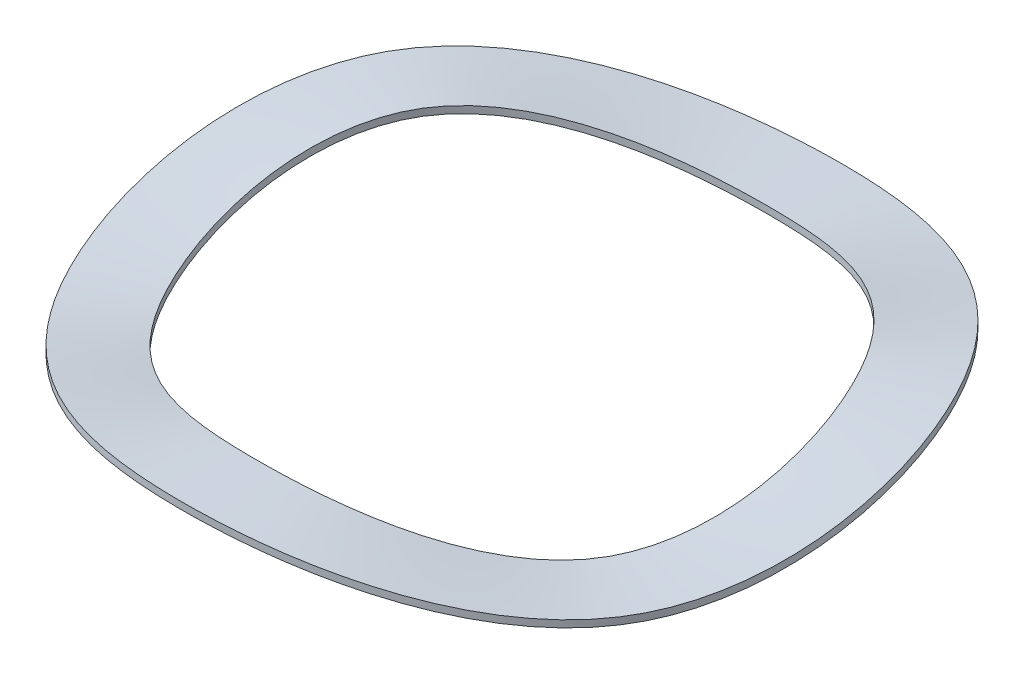
ISO-10303-21;
HEADER;
FILE_DESCRIPTION(('STEP AP214'),'2;1');
FILE_NAME('part.step','',(''),(''),'','','');
FILE_SCHEMA(('AUTOMOTIVE_DESIGN { 1 0 10303 214 1 1 1 1 }'));
ENDSEC;
DATA;
#1=APPLICATION_CONTEXT('core data for automotive mechanical design processes');
#2=APPLICATION_PROTOCOL_DEFINITION('international standard','automotive_design',2000,#1);
#3=PRODUCT_CONTEXT('',#1,'mechanical');
#4=PRODUCT('Part','Part','',(#3));
#5=PRODUCT_RELATED_PRODUCT_CATEGORY('part','',(#4));
#6=PRODUCT_DEFINITION_FORMATION('','',#4);
#7=PRODUCT_DEFINITION_CONTEXT('part definition',#1,'design');
#8=PRODUCT_DEFINITION('design','',#6,#7);
#9=PRODUCT_DEFINITION_SHAPE('','',#8);
#10=(LENGTH_UNIT() NAMED_UNIT(*) SI_UNIT(.MILLI.,.METRE.));
#11=(NAMED_UNIT(*) PLANE_ANGLE_UNIT() SI_UNIT($,.RADIAN.));
#12=(NAMED_UNIT(*) SI_UNIT($,.STERADIAN.) SOLID_ANGLE_UNIT());
#13=UNCERTAINTY_MEASURE_WITH_UNIT(LENGTH_MEASURE(1.E-05),#10,'distance_accuracy_value','');
#14=(GEOMETRIC_REPRESENTATION_CONTEXT(3) GLOBAL_UNCERTAINTY_ASSIGNED_CONTEXT((#13)) GLOBAL_UNIT_ASSIGNED_CONTEXT((#10,
#11,#12)) REPRESENTATION_CONTEXT('',''));
#15=CARTESIAN_POINT('',(0.,0.,0.));
#16=DIRECTION('',(0.,0.,1.));
#17=DIRECTION('',(1.,0.,0.));
#18=AXIS2_PLACEMENT_3D('',#15,#16,#17);
#19=CARTESIAN_POINT('',(0.,0.,-10.6553));
#20=CARTESIAN_POINT('',(3.69110419397773,0.,-10.6553));
#21=CARTESIAN_POINT('',(11.0733125819332,3.1242,-6.39318));
#22=CARTESIAN_POINT('',(11.0733125819332,-1.5621,6.39318000000003));
#23=CARTESIAN_POINT('',(0.,3.12419999999999,12.78636));
#24=CARTESIAN_POINT('',(-11.0733125819332,-1.5621,6.39317999999996));
#25=CARTESIAN_POINT('',(-11.0733125819332,1.5621,-2.13106000000005));
#26=CARTESIAN_POINT('',(-7.38220838795543,1.5621,-8.52424000000004));
#27=CARTESIAN_POINT('',(-3.69110419397772,0.,-10.6553));
#28=CARTESIAN_POINT('',(0.,0.,-10.6553));
#29=CARTESIAN_POINT('',(0.,0.,-11.6755333333333));
#30=CARTESIAN_POINT('',(4.04452338775946,0.,-11.6755333333333));
#31=CARTESIAN_POINT('',(12.1335701632784,3.1242,-7.00532));
#32=CARTESIAN_POINT('',(12.1335701632784,-1.5621,7.00532000000003));
#33=CARTESIAN_POINT('',(0.,3.1242,14.01064));
#34=CARTESIAN_POINT('',(-12.1335701632785,-1.5621,7.00531999999996));
#35=CARTESIAN_POINT('',(-12.1335701632784,1.5621,-2.33510666666672));
#36=CARTESIAN_POINT('',(-8.08904677551891,1.5621,-9.34042666666671));
#37=CARTESIAN_POINT('',(-4.04452338775946,0.,-11.6755333333333));
#38=CARTESIAN_POINT('',(0.,0.,-11.6755333333333));
#39=CARTESIAN_POINT('',(0.,0.,-12.6957666666667));
#40=CARTESIAN_POINT('',(4.3979425815412,0.,-12.6957666666667));
#41=CARTESIAN_POINT('',(13.1938277446236,3.1242,-7.61746));
#42=CARTESIAN_POINT('',(13.1938277446236,-1.5621,7.61746000000003));
#43=CARTESIAN_POINT('',(0.,3.1242,15.23492));
#44=CARTESIAN_POINT('',(-13.1938277446237,-1.5621,7.61745999999995));
#45=CARTESIAN_POINT('',(-13.1938277446236,1.5621,-2.53915333333339));
#46=CARTESIAN_POINT('',(-8.79588516308238,1.5621,-10.1566133333334));
#47=CARTESIAN_POINT('',(-4.3979425815412,0.,-12.6957666666667));
#48=CARTESIAN_POINT('',(0.,0.,-12.6957666666667));
#49=CARTESIAN_POINT('',(0.,0.,-13.716));
#50=CARTESIAN_POINT('',(4.75136177532294,0.,-13.716));
#51=CARTESIAN_POINT('',(14.2540853259689,3.1242,-8.2296));
#52=CARTESIAN_POINT('',(14.2540853259688,-1.5621,8.22960000000003));
#53=CARTESIAN_POINT('',(0.,3.1242,16.4592));
#54=CARTESIAN_POINT('',(-14.2540853259689,-1.5621,8.22959999999994));
#55=CARTESIAN_POINT('',(-14.2540853259688,1.5621,-2.74320000000006));
#56=CARTESIAN_POINT('',(-9.50272355064585,1.5621,-10.9728));
#57=CARTESIAN_POINT('',(-4.75136177532293,0.,-13.716));
#58=CARTESIAN_POINT('',(0.,0.,-13.716));
#59=B_SPLINE_SURFACE_WITH_KNOTS('',3,3,((#19,#20,#21,#22,#23,#24,#25,#26,#27,#28),(#29,#30,#31,
#32,#33,#34,#35,#36,#37,#38),(#39,#40,#41,#42,#43,#44,#45,#46,#47,#48),(#49,#50,#51,#52,#53,#54,
#55,#56,#57,#58)),.UNSPECIFIED.,.F.,.T.,.F.,(4,4),(4,1,1,1,1,2,4),(0.,1.),(0.,0.166666666666667,
0.333333333333334,0.5,0.666666666666666,0.833333333333333,1.),.UNSPECIFIED.);
#60=CARTESIAN_POINT('',(0.,0.,-13.716));
#61=CARTESIAN_POINT('',(4.75136177532294,0.,-13.716));
#62=CARTESIAN_POINT('',(14.2540853259689,3.1242,-8.2296));
#63=CARTESIAN_POINT('',(14.2540853259688,-1.5621,8.22960000000003));
#64=CARTESIAN_POINT('',(0.,3.1242,16.4592));
#65=CARTESIAN_POINT('',(-14.2540853259689,-1.5621,8.22959999999994));
#66=CARTESIAN_POINT('',(-14.2540853259688,1.5621,-2.74320000000006));
#67=CARTESIAN_POINT('',(-9.50272355064585,1.5621,-10.9728));
#68=CARTESIAN_POINT('',(-4.75136177532293,0.,-13.716));
#69=CARTESIAN_POINT('',(0.,0.,-13.716));
#70=B_SPLINE_CURVE_WITH_KNOTS('',3,(#60,#61,#62,#63,#64,#65,#66,#67,#68,#69),.UNSPECIFIED.,.T.,
.F.,(4,1,1,1,1,2,4),(0.,0.166666666666667,0.333333333333334,0.5,0.666666666666666,
0.833333333333333,1.),.UNSPECIFIED.);
#71=CARTESIAN_POINT('',(0.,0.,-13.716));
#72=VERTEX_POINT('',#71);
#73=EDGE_CURVE('E20',#72,#72,#70,.F.);
#74=CARTESIAN_POINT('',(0.,0.,-10.6553));
#75=CARTESIAN_POINT('',(3.69110419397773,0.,-10.6553));
#76=CARTESIAN_POINT('',(11.0733125819332,3.1242,-6.39318));
#77=CARTESIAN_POINT('',(11.0733125819332,-1.5621,6.39318000000003));
#78=CARTESIAN_POINT('',(0.,3.12419999999999,12.78636));
#79=CARTESIAN_POINT('',(-11.0733125819332,-1.5621,6.39317999999996));
#80=CARTESIAN_POINT('',(-11.0733125819332,1.5621,-2.13106000000005));
#81=CARTESIAN_POINT('',(-7.38220838795543,1.5621,-8.52424000000004));
#82=CARTESIAN_POINT('',(-3.69110419397772,0.,-10.6553));
#83=CARTESIAN_POINT('',(0.,0.,-10.6553));
#84=B_SPLINE_CURVE_WITH_KNOTS('',3,(#74,#75,#76,#77,#78,#79,#80,#81,#82,#83),.UNSPECIFIED.,.T.,
.F.,(4,1,1,1,1,2,4),(0.,0.166666666666667,0.333333333333334,0.5,0.666666666666666,
0.833333333333333,1.),.UNSPECIFIED.);
#85=CARTESIAN_POINT('',(0.,0.,-10.6553));
#86=VERTEX_POINT('',#85);
#87=EDGE_CURVE('E36',#86,#86,#84,.T.);
#88=ORIENTED_EDGE('',*,*,#73,.F.);
#89=EDGE_LOOP('',(#88));
#90=FACE_BOUND('',#89,.T.);
#91=ORIENTED_EDGE('',*,*,#87,.F.);
#92=EDGE_LOOP('',(#91));
#93=FACE_BOUND('',#92,.T.);
#94=ADVANCED_FACE('F14',(#90,#93),#59,.T.);
#95=CARTESIAN_POINT('',(0.,0.,-13.716));
#96=CARTESIAN_POINT('',(4.75136177532294,0.,-13.716));
#97=CARTESIAN_POINT('',(14.2540853259689,3.1242,-8.2296));
#98=CARTESIAN_POINT('',(14.2540853259688,-1.5621,8.22960000000003));
#99=CARTESIAN_POINT('',(0.,3.1242,16.4592));
#100=CARTESIAN_POINT('',(-14.2540853259689,-1.5621,8.22959999999994));
#101=CARTESIAN_POINT('',(-14.2540853259688,1.5621,-2.74320000000006));
#102=CARTESIAN_POINT('',(-9.50272355064585,1.5621,-10.9728));
#103=CARTESIAN_POINT('',(-4.75136177532293,0.,-13.716));
#104=CARTESIAN_POINT('',(0.,0.,-13.716));
#105=CARTESIAN_POINT('',(0.,0.0973666666666665,-13.716));
#106=CARTESIAN_POINT('',(4.75136177532294,0.0973666666666662,-13.716));
#107=CARTESIAN_POINT('',(14.2540853259689,3.22156666666667,-8.2296));
#108=CARTESIAN_POINT('',(14.2540853259688,-1.46473333333333,8.22960000000003));
#109=CARTESIAN_POINT('',(0.,3.22156666666666,16.4592));
#110=CARTESIAN_POINT('',(-14.2540853259689,-1.46473333333333,8.22959999999994));
#111=CARTESIAN_POINT('',(-14.2540853259688,1.65946666666666,-2.74320000000006));
#112=CARTESIAN_POINT('',(-9.50272355064585,1.65946666666667,-10.9728));
#113=CARTESIAN_POINT('',(-4.75136177532293,0.0973666666666667,-13.716));
#114=CARTESIAN_POINT('',(0.,0.0973666666666665,-13.716));
#115=CARTESIAN_POINT('',(0.,0.194733333333333,-13.716));
#116=CARTESIAN_POINT('',(4.75136177532294,0.194733333333333,-13.716));
#117=CARTESIAN_POINT('',(14.2540853259689,3.31893333333333,-8.2296));
#118=CARTESIAN_POINT('',(14.2540853259688,-1.36736666666666,8.22960000000003));
#119=CARTESIAN_POINT('',(0.,3.31893333333333,16.4592));
#120=CARTESIAN_POINT('',(-14.2540853259689,-1.36736666666667,8.22959999999994));
#121=CARTESIAN_POINT('',(-14.2540853259688,1.75683333333333,-2.74320000000006));
#122=CARTESIAN_POINT('',(-9.50272355064585,1.75683333333334,-10.9728));
#123=CARTESIAN_POINT('',(-4.75136177532293,0.194733333333333,-13.716));
#124=CARTESIAN_POINT('',(0.,0.194733333333333,-13.716));
#125=CARTESIAN_POINT('',(0.,0.292099999999999,-13.716));
#126=CARTESIAN_POINT('',(4.75136177532294,0.292099999999999,-13.716));
#127=CARTESIAN_POINT('',(14.2540853259689,3.4163,-8.2296));
#128=CARTESIAN_POINT('',(14.2540853259688,-1.27,8.22960000000003));
#129=CARTESIAN_POINT('',(0.,3.4163,16.4592));
#130=CARTESIAN_POINT('',(-14.2540853259689,-1.27,8.22959999999994));
#131=CARTESIAN_POINT('',(-14.2540853259688,1.8542,-2.74320000000006));
#132=CARTESIAN_POINT('',(-9.50272355064585,1.8542,-10.9728));
#133=CARTESIAN_POINT('',(-4.75136177532293,0.2921,-13.716));
#134=CARTESIAN_POINT('',(0.,0.292099999999999,-13.716));
#135=B_SPLINE_SURFACE_WITH_KNOTS('',3,3,((#95,#96,#97,#98,#99,#100,#101,#102,#103,#104),(#105,
#106,#107,#108,#109,#110,#111,#112,#113,#114),(#115,#116,#117,#118,#119,#120,#121,#122,#123,
#124),(#125,#126,#127,#128,#129,#130,#131,#132,#133,#134)),.UNSPECIFIED.,.F.,.T.,.F.,(4,4),(4,1,
1,1,1,2,4),(0.,1.),(0.,0.166666666666667,0.333333333333334,0.5,0.666666666666666,
0.833333333333333,1.),.UNSPECIFIED.);
#136=CARTESIAN_POINT('',(0.,0.292099999999999,-13.716));
#137=CARTESIAN_POINT('',(4.75136177532294,0.292099999999999,-13.716));
#138=CARTESIAN_POINT('',(14.2540853259689,3.4163,-8.2296));
#139=CARTESIAN_POINT('',(14.2540853259688,-1.27,8.22960000000003));
#140=CARTESIAN_POINT('',(0.,3.4163,16.4592));
#141=CARTESIAN_POINT('',(-14.2540853259689,-1.27,8.22959999999994));
#142=CARTESIAN_POINT('',(-14.2540853259688,1.8542,-2.74320000000006));
#143=CARTESIAN_POINT('',(-9.50272355064585,1.8542,-10.9728));
#144=CARTESIAN_POINT('',(-4.75136177532293,0.2921,-13.716));
#145=CARTESIAN_POINT('',(0.,0.292099999999999,-13.716));
#146=B_SPLINE_CURVE_WITH_KNOTS('',3,(#136,#137,#138,#139,#140,#141,#142,#143,#144,#145),
.UNSPECIFIED.,.T.,.F.,(4,1,1,1,1,2,4),(0.,0.166666666666667,0.333333333333334,0.5,
0.666666666666666,0.833333333333333,1.),.UNSPECIFIED.);
#147=CARTESIAN_POINT('',(0.,0.292099999999999,-13.716));
#148=VERTEX_POINT('',#147);
#149=EDGE_CURVE('E27',#148,#148,#146,.F.);
#150=ORIENTED_EDGE('',*,*,#149,.F.);
#151=EDGE_LOOP('',(#150));
#152=FACE_BOUND('',#151,.T.);
#153=ORIENTED_EDGE('',*,*,#73,.T.);
#154=EDGE_LOOP('',(#153));
#155=FACE_BOUND('',#154,.T.);
#156=ADVANCED_FACE('F59',(#152,#155),#135,.T.);
#157=CARTESIAN_POINT('',(0.,0.292099999999999,-10.6553));
#158=CARTESIAN_POINT('',(3.69110419397773,0.292099999999999,-10.6553));
#159=CARTESIAN_POINT('',(11.0733125819332,3.4163,-6.39318));
#160=CARTESIAN_POINT('',(11.0733125819332,-1.27,6.39318000000003));
#161=CARTESIAN_POINT('',(0.,3.4163,12.78636));
#162=CARTESIAN_POINT('',(-11.0733125819332,-1.27000000000001,6.39317999999996));
#163=CARTESIAN_POINT('',(-11.0733125819332,1.8542,-2.13106000000005));
#164=CARTESIAN_POINT('',(-7.38220838795543,1.8542,-8.52424000000004));
#165=CARTESIAN_POINT('',(-3.69110419397772,0.2921,-10.6553));
#166=CARTESIAN_POINT('',(0.,0.292099999999999,-10.6553));
#167=CARTESIAN_POINT('',(0.,0.194733333333333,-10.6553));
#168=CARTESIAN_POINT('',(3.69110419397773,0.194733333333332,-10.6553));
#169=CARTESIAN_POINT('',(11.0733125819332,3.31893333333334,-6.39318));
#170=CARTESIAN_POINT('',(11.0733125819332,-1.36736666666667,6.39318000000003));
#171=CARTESIAN_POINT('',(0.,3.31893333333333,12.78636));
#172=CARTESIAN_POINT('',(-11.0733125819332,-1.36736666666667,6.39317999999996));
#173=CARTESIAN_POINT('',(-11.0733125819332,1.75683333333333,-2.13106000000005));
#174=CARTESIAN_POINT('',(-7.38220838795543,1.75683333333334,-8.52424000000004));
#175=CARTESIAN_POINT('',(-3.69110419397772,0.194733333333333,-10.6553));
#176=CARTESIAN_POINT('',(0.,0.194733333333333,-10.6553));
#177=CARTESIAN_POINT('',(0.,0.0973666666666658,-10.6553));
#178=CARTESIAN_POINT('',(3.69110419397773,0.0973666666666655,-10.6553));
#179=CARTESIAN_POINT('',(11.0733125819332,3.22156666666667,-6.39318));
#180=CARTESIAN_POINT('',(11.0733125819332,-1.46473333333333,6.39318000000003));
#181=CARTESIAN_POINT('',(0.,3.22156666666666,12.78636));
#182=CARTESIAN_POINT('',(-11.0733125819332,-1.46473333333333,6.39317999999996));
#183=CARTESIAN_POINT('',(-11.0733125819332,1.65946666666666,-2.13106000000005));
#184=CARTESIAN_POINT('',(-7.38220838795543,1.65946666666667,-8.52424000000004));
#185=CARTESIAN_POINT('',(-3.69110419397772,0.0973666666666661,-10.6553));
#186=CARTESIAN_POINT('',(0.,0.0973666666666658,-10.6553));
#187=CARTESIAN_POINT('',(0.,0.,-10.6553));
#188=CARTESIAN_POINT('',(3.69110419397773,0.,-10.6553));
#189=CARTESIAN_POINT('',(11.0733125819332,3.1242,-6.39318));
#190=CARTESIAN_POINT('',(11.0733125819332,-1.5621,6.39318000000003));
#191=CARTESIAN_POINT('',(0.,3.12419999999999,12.78636));
#192=CARTESIAN_POINT('',(-11.0733125819332,-1.5621,6.39317999999996));
#193=CARTESIAN_POINT('',(-11.0733125819332,1.5621,-2.13106000000005));
#194=CARTESIAN_POINT('',(-7.38220838795543,1.5621,-8.52424000000004));
#195=CARTESIAN_POINT('',(-3.69110419397772,0.,-10.6553));
#196=CARTESIAN_POINT('',(0.,0.,-10.6553));
#197=B_SPLINE_SURFACE_WITH_KNOTS('',3,3,((#157,#158,#159,#160,#161,#162,#163,#164,#165,#166),
(#167,#168,#169,#170,#171,#172,#173,#174,#175,#176),(#177,#178,#179,#180,#181,#182,#183,#184,
#185,#186),(#187,#188,#189,#190,#191,#192,#193,#194,#195,#196)),.UNSPECIFIED.,.F.,.T.,.F.,(4,4),
(4,1,1,1,1,2,4),(0.,1.),(0.,0.166666666666667,0.333333333333334,0.5,0.666666666666666,
0.833333333333333,1.),.UNSPECIFIED.);
#198=CARTESIAN_POINT('',(0.,0.292099999999999,-10.6553));
#199=CARTESIAN_POINT('',(3.69110419397773,0.292099999999999,-10.6553));
#200=CARTESIAN_POINT('',(11.0733125819332,3.4163,-6.39318));
#201=CARTESIAN_POINT('',(11.0733125819332,-1.27,6.39318000000003));
#202=CARTESIAN_POINT('',(0.,3.4163,12.78636));
#203=CARTESIAN_POINT('',(-11.0733125819332,-1.27000000000001,6.39317999999997));
#204=CARTESIAN_POINT('',(-11.0733125819332,1.8542,-2.13106000000005));
#205=CARTESIAN_POINT('',(-7.38220838795543,1.8542,-8.52424000000004));
#206=CARTESIAN_POINT('',(-3.69110419397772,0.2921,-10.6553));
#207=CARTESIAN_POINT('',(0.,0.292099999999999,-10.6553));
#208=B_SPLINE_CURVE_WITH_KNOTS('',3,(#198,#199,#200,#201,#202,#203,#204,#205,#206,#207),
.UNSPECIFIED.,.T.,.F.,(4,1,1,1,1,2,4),(0.,0.166666666666667,0.333333333333334,0.5,
0.666666666666666,0.833333333333333,1.),.UNSPECIFIED.);
#209=CARTESIAN_POINT('',(0.,0.292099999999999,-10.6553));
#210=VERTEX_POINT('',#209);
#211=EDGE_CURVE('E10',#210,#210,#208,.T.);
#212=ORIENTED_EDGE('',*,*,#87,.T.);
#213=EDGE_LOOP('',(#212));
#214=FACE_BOUND('',#213,.T.);
#215=ORIENTED_EDGE('',*,*,#211,.F.);
#216=EDGE_LOOP('',(#215));
#217=FACE_BOUND('',#216,.T.);
#218=ADVANCED_FACE('F68',(#214,#217),#197,.T.);
#219=CARTESIAN_POINT('',(0.,0.292099999999999,-13.716));
#220=CARTESIAN_POINT('',(4.75136177532294,0.292099999999999,-13.716));
#221=CARTESIAN_POINT('',(14.2540853259689,3.4163,-8.2296));
#222=CARTESIAN_POINT('',(14.2540853259688,-1.27,8.22960000000003));
#223=CARTESIAN_POINT('',(0.,3.4163,16.4592));
#224=CARTESIAN_POINT('',(-14.2540853259689,-1.27,8.22959999999994));
#225=CARTESIAN_POINT('',(-14.2540853259688,1.8542,-2.74320000000006));
#226=CARTESIAN_POINT('',(-9.50272355064585,1.8542,-10.9728));
#227=CARTESIAN_POINT('',(-4.75136177532293,0.2921,-13.716));
#228=CARTESIAN_POINT('',(0.,0.292099999999999,-13.716));
#229=CARTESIAN_POINT('',(0.,0.292099999999999,-12.6957666666667));
#230=CARTESIAN_POINT('',(4.3979425815412,0.292099999999999,-12.6957666666667));
#231=CARTESIAN_POINT('',(13.1938277446236,3.4163,-7.61746));
#232=CARTESIAN_POINT('',(13.1938277446236,-1.27,7.61746000000003));
#233=CARTESIAN_POINT('',(0.,3.4163,15.23492));
#234=CARTESIAN_POINT('',(-13.1938277446237,-1.27,7.61745999999995));
#235=CARTESIAN_POINT('',(-13.1938277446236,1.8542,-2.53915333333339));
#236=CARTESIAN_POINT('',(-8.79588516308238,1.8542,-10.1566133333334));
#237=CARTESIAN_POINT('',(-4.3979425815412,0.2921,-12.6957666666667));
#238=CARTESIAN_POINT('',(0.,0.292099999999999,-12.6957666666667));
#239=CARTESIAN_POINT('',(0.,0.292099999999999,-11.6755333333333));
#240=CARTESIAN_POINT('',(4.04452338775947,0.292099999999998,-11.6755333333333));
#241=CARTESIAN_POINT('',(12.1335701632784,3.4163,-7.00532));
#242=CARTESIAN_POINT('',(12.1335701632784,-1.27,7.00532000000003));
#243=CARTESIAN_POINT('',(0.,3.4163,14.01064));
#244=CARTESIAN_POINT('',(-12.1335701632785,-1.27000000000001,7.00531999999996));
#245=CARTESIAN_POINT('',(-12.1335701632784,1.8542,-2.33510666666672));
#246=CARTESIAN_POINT('',(-8.08904677551891,1.8542,-9.34042666666671));
#247=CARTESIAN_POINT('',(-4.04452338775946,0.2921,-11.6755333333333));
#248=CARTESIAN_POINT('',(0.,0.292099999999999,-11.6755333333333));
#249=CARTESIAN_POINT('',(0.,0.292099999999999,-10.6553));
#250=CARTESIAN_POINT('',(3.69110419397773,0.292099999999999,-10.6553));
#251=CARTESIAN_POINT('',(11.0733125819332,3.4163,-6.39318));
#252=CARTESIAN_POINT('',(11.0733125819332,-1.27,6.39318000000003));
#253=CARTESIAN_POINT('',(0.,3.4163,12.78636));
#254=CARTESIAN_POINT('',(-11.0733125819332,-1.27000000000001,6.39317999999997));
#255=CARTESIAN_POINT('',(-11.0733125819332,1.8542,-2.13106000000005));
#256=CARTESIAN_POINT('',(-7.38220838795543,1.8542,-8.52424000000004));
#257=CARTESIAN_POINT('',(-3.69110419397772,0.2921,-10.6553));
#258=CARTESIAN_POINT('',(0.,0.292099999999999,-10.6553));
#259=B_SPLINE_SURFACE_WITH_KNOTS('',3,3,((#219,#220,#221,#222,#223,#224,#225,#226,#227,#228),
(#229,#230,#231,#232,#233,#234,#235,#236,#237,#238),(#239,#240,#241,#242,#243,#244,#245,#246,
#247,#248),(#249,#250,#251,#252,#253,#254,#255,#256,#257,#258)),.UNSPECIFIED.,.F.,.T.,.F.,(4,4),
(4,1,1,1,1,2,4),(0.,1.),(0.,0.166666666666667,0.333333333333334,0.5,0.666666666666666,
0.833333333333333,1.),.UNSPECIFIED.);
#260=ORIENTED_EDGE('',*,*,#211,.T.);
#261=EDGE_LOOP('',(#260));
#262=FACE_BOUND('',#261,.T.);
#263=ORIENTED_EDGE('',*,*,#149,.T.);
#264=EDGE_LOOP('',(#263));
#265=FACE_BOUND('',#264,.T.);
#266=ADVANCED_FACE('F16',(#262,#265),#259,.T.);
#267=CLOSED_SHELL('',(#94,#156,#218,#266));
#268=MANIFOLD_SOLID_BREP('B1',#267);
#269=ADVANCED_BREP_SHAPE_REPRESENTATION('',(#18,#268),#14);
#270=SHAPE_DEFINITION_REPRESENTATION(#9,#269);
ENDSEC;
END-ISO-10303-21;
